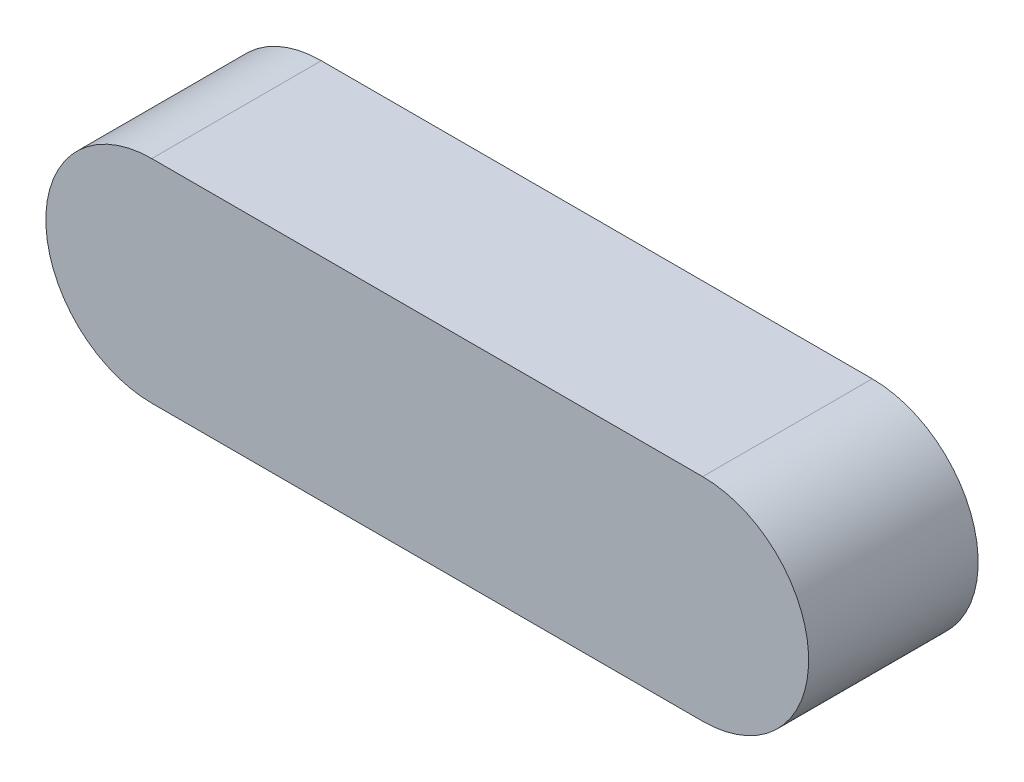
ISO-10303-21;
HEADER;
FILE_DESCRIPTION(('STEP AP214'),'2;1');
FILE_NAME('part.step','',(''),(''),'','','');
FILE_SCHEMA(('AUTOMOTIVE_DESIGN { 1 0 10303 214 1 1 1 1 }'));
ENDSEC;
DATA;
#1=APPLICATION_CONTEXT('core data for automotive mechanical design processes');
#2=APPLICATION_PROTOCOL_DEFINITION('international standard','automotive_design',2000,#1);
#3=PRODUCT_CONTEXT('',#1,'mechanical');
#4=PRODUCT('Part','Part','',(#3));
#5=PRODUCT_RELATED_PRODUCT_CATEGORY('part','',(#4));
#6=PRODUCT_DEFINITION_FORMATION('','',#4);
#7=PRODUCT_DEFINITION_CONTEXT('part definition',#1,'design');
#8=PRODUCT_DEFINITION('design','',#6,#7);
#9=PRODUCT_DEFINITION_SHAPE('','',#8);
#10=(LENGTH_UNIT() NAMED_UNIT(*) SI_UNIT(.MILLI.,.METRE.));
#11=(NAMED_UNIT(*) PLANE_ANGLE_UNIT() SI_UNIT($,.RADIAN.));
#12=(NAMED_UNIT(*) SI_UNIT($,.STERADIAN.) SOLID_ANGLE_UNIT());
#13=UNCERTAINTY_MEASURE_WITH_UNIT(LENGTH_MEASURE(1.E-05),#10,'distance_accuracy_value','');
#14=(GEOMETRIC_REPRESENTATION_CONTEXT(3) GLOBAL_UNCERTAINTY_ASSIGNED_CONTEXT((#13)) GLOBAL_UNIT_ASSIGNED_CONTEXT((#10,
#11,#12)) REPRESENTATION_CONTEXT('',''));
#15=CARTESIAN_POINT('',(0.,0.,0.));
#16=DIRECTION('',(0.,0.,1.));
#17=DIRECTION('',(1.,0.,0.));
#18=AXIS2_PLACEMENT_3D('',#15,#16,#17);
#19=CARTESIAN_POINT('',(-5.41501976284585,0.,8.));
#20=DIRECTION('',(0.,0.,-1.));
#21=DIRECTION('',(-1.,0.,0.));
#22=AXIS2_PLACEMENT_3D('',#19,#20,#21);
#23=CYLINDRICAL_SURFACE('',#22,5.);
#24=CARTESIAN_POINT('',(-5.41501976284585,0.,0.));
#25=DIRECTION('',(0.,0.,1.));
#26=DIRECTION('',(1.,0.,0.));
#27=AXIS2_PLACEMENT_3D('',#24,#25,#26);
#28=CIRCLE('',#27,5.);
#29=CARTESIAN_POINT('',(-5.41501976284585,5.,0.));
#30=VERTEX_POINT('',#29);
#31=CARTESIAN_POINT('',(-5.41501976284585,-5.,0.));
#32=VERTEX_POINT('',#31);
#33=EDGE_CURVE('E107',#30,#32,#28,.T.);
#34=ORIENTED_EDGE('',*,*,#33,.T.);
#35=DIRECTION('',(0.,0.,-1.));
#36=VECTOR('',#35,1.);
#37=CARTESIAN_POINT('',(-5.41501976284585,-5.,8.));
#38=LINE('',#37,#36);
#39=CARTESIAN_POINT('',(-5.41501976284585,-5.,8.));
#40=VERTEX_POINT('',#39);
#41=EDGE_CURVE('E11',#40,#32,#38,.T.);
#42=ORIENTED_EDGE('',*,*,#41,.F.);
#43=CARTESIAN_POINT('',(-5.41501976284585,0.,8.));
#44=DIRECTION('',(0.,0.,1.));
#45=DIRECTION('',(1.,0.,0.));
#46=AXIS2_PLACEMENT_3D('',#43,#44,#45);
#47=CIRCLE('',#46,5.);
#48=CARTESIAN_POINT('',(-5.41501976284585,5.,8.));
#49=VERTEX_POINT('',#48);
#50=EDGE_CURVE('E91',#49,#40,#47,.T.);
#51=ORIENTED_EDGE('',*,*,#50,.F.);
#52=DIRECTION('',(0.,0.,-1.));
#53=VECTOR('',#52,1.);
#54=CARTESIAN_POINT('',(-5.41501976284585,5.,8.));
#55=LINE('',#54,#53);
#56=EDGE_CURVE('E103',#49,#30,#55,.T.);
#57=ORIENTED_EDGE('',*,*,#56,.T.);
#58=EDGE_LOOP('',(#34,#42,#51,#57));
#59=FACE_BOUND('',#58,.T.);
#60=ADVANCED_FACE('F39',(#59),#23,.T.);
#61=CARTESIAN_POINT('',(-5.41501976284585,-5.,8.));
#62=DIRECTION('',(0.,1.,0.));
#63=DIRECTION('',(0.,0.,1.));
#64=AXIS2_PLACEMENT_3D('',#61,#62,#63);
#65=PLANE('',#64);
#66=DIRECTION('',(1.,0.,0.));
#67=VECTOR('',#66,1.);
#68=CARTESIAN_POINT('',(-5.41501976284585,-5.,0.));
#69=LINE('',#68,#67);
#70=CARTESIAN_POINT('',(20.5849802371542,-5.,0.));
#71=VERTEX_POINT('',#70);
#72=EDGE_CURVE('E96',#32,#71,#69,.T.);
#73=ORIENTED_EDGE('',*,*,#72,.T.);
#74=DIRECTION('',(0.,0.,-1.));
#75=VECTOR('',#74,1.);
#76=CARTESIAN_POINT('',(20.5849802371542,-5.,8.));
#77=LINE('',#76,#75);
#78=CARTESIAN_POINT('',(20.5849802371542,-5.,8.));
#79=VERTEX_POINT('',#78);
#80=EDGE_CURVE('E48',#79,#71,#77,.T.);
#81=ORIENTED_EDGE('',*,*,#80,.F.);
#82=DIRECTION('',(1.,0.,0.));
#83=VECTOR('',#82,1.);
#84=CARTESIAN_POINT('',(-5.41501976284585,-5.,8.));
#85=LINE('',#84,#83);
#86=EDGE_CURVE('E86',#40,#79,#85,.T.);
#87=ORIENTED_EDGE('',*,*,#86,.F.);
#88=ORIENTED_EDGE('',*,*,#41,.T.);
#89=EDGE_LOOP('',(#73,#81,#87,#88));
#90=FACE_BOUND('',#89,.T.);
#91=ADVANCED_FACE('F95',(#90),#65,.F.);
#92=CARTESIAN_POINT('',(20.5849802371542,0.,8.));
#93=DIRECTION('',(0.,0.,-1.));
#94=DIRECTION('',(-1.,0.,0.));
#95=AXIS2_PLACEMENT_3D('',#92,#93,#94);
#96=CYLINDRICAL_SURFACE('',#95,5.);
#97=CARTESIAN_POINT('',(20.5849802371542,0.,0.));
#98=DIRECTION('',(0.,0.,1.));
#99=DIRECTION('',(1.,0.,0.));
#100=AXIS2_PLACEMENT_3D('',#97,#98,#99);
#101=CIRCLE('',#100,5.);
#102=CARTESIAN_POINT('',(20.5849802371542,5.,0.));
#103=VERTEX_POINT('',#102);
#104=EDGE_CURVE('E73',#71,#103,#101,.T.);
#105=ORIENTED_EDGE('',*,*,#104,.T.);
#106=DIRECTION('',(0.,0.,-1.));
#107=VECTOR('',#106,1.);
#108=CARTESIAN_POINT('',(20.5849802371542,5.,8.));
#109=LINE('',#108,#107);
#110=CARTESIAN_POINT('',(20.5849802371542,5.,8.));
#111=VERTEX_POINT('',#110);
#112=EDGE_CURVE('E98',#111,#103,#109,.T.);
#113=ORIENTED_EDGE('',*,*,#112,.F.);
#114=CARTESIAN_POINT('',(20.5849802371542,0.,8.));
#115=DIRECTION('',(0.,0.,1.));
#116=DIRECTION('',(1.,0.,0.));
#117=AXIS2_PLACEMENT_3D('',#114,#115,#116);
#118=CIRCLE('',#117,5.);
#119=EDGE_CURVE('E89',#79,#111,#118,.T.);
#120=ORIENTED_EDGE('',*,*,#119,.F.);
#121=ORIENTED_EDGE('',*,*,#80,.T.);
#122=EDGE_LOOP('',(#105,#113,#120,#121));
#123=FACE_BOUND('',#122,.T.);
#124=ADVANCED_FACE('F99',(#123),#96,.T.);
#125=CARTESIAN_POINT('',(-5.41501976284585,5.,8.));
#126=DIRECTION('',(0.,-1.,0.));
#127=DIRECTION('',(0.,0.,-1.));
#128=AXIS2_PLACEMENT_3D('',#125,#126,#127);
#129=PLANE('',#128);
#130=DIRECTION('',(-1.,0.,0.));
#131=VECTOR('',#130,1.);
#132=CARTESIAN_POINT('',(-5.41501976284585,5.,0.));
#133=LINE('',#132,#131);
#134=EDGE_CURVE('E79',#103,#30,#133,.T.);
#135=ORIENTED_EDGE('',*,*,#134,.T.);
#136=ORIENTED_EDGE('',*,*,#56,.F.);
#137=DIRECTION('',(-1.,0.,0.));
#138=VECTOR('',#137,1.);
#139=CARTESIAN_POINT('',(-5.41501976284585,5.,8.));
#140=LINE('',#139,#138);
#141=EDGE_CURVE('E56',#111,#49,#140,.T.);
#142=ORIENTED_EDGE('',*,*,#141,.F.);
#143=ORIENTED_EDGE('',*,*,#112,.T.);
#144=EDGE_LOOP('',(#135,#136,#142,#143));
#145=FACE_BOUND('',#144,.T.);
#146=ADVANCED_FACE('F120',(#145),#129,.F.);
#147=CARTESIAN_POINT('',(-5.41501976284585,0.,8.));
#148=DIRECTION('',(0.,0.,1.));
#149=DIRECTION('',(1.,0.,0.));
#150=AXIS2_PLACEMENT_3D('',#147,#148,#149);
#151=PLANE('',#150);
#152=ORIENTED_EDGE('',*,*,#50,.T.);
#153=ORIENTED_EDGE('',*,*,#86,.T.);
#154=ORIENTED_EDGE('',*,*,#119,.T.);
#155=ORIENTED_EDGE('',*,*,#141,.T.);
#156=EDGE_LOOP('',(#152,#153,#154,#155));
#157=FACE_BOUND('',#156,.T.);
#158=ADVANCED_FACE('F87',(#157),#151,.T.);
#159=CARTESIAN_POINT('',(-5.41501976284585,0.,0.));
#160=DIRECTION('',(0.,0.,1.));
#161=DIRECTION('',(1.,0.,0.));
#162=AXIS2_PLACEMENT_3D('',#159,#160,#161);
#163=PLANE('',#162);
#164=ORIENTED_EDGE('',*,*,#33,.F.);
#165=ORIENTED_EDGE('',*,*,#134,.F.);
#166=ORIENTED_EDGE('',*,*,#104,.F.);
#167=ORIENTED_EDGE('',*,*,#72,.F.);
#168=EDGE_LOOP('',(#164,#165,#166,#167));
#169=FACE_BOUND('',#168,.T.);
#170=ADVANCED_FACE('F123',(#169),#163,.F.);
#171=CLOSED_SHELL('',(#60,#91,#124,#146,#158,#170));
#172=MANIFOLD_SOLID_BREP('B2',#171);
#173=ADVANCED_BREP_SHAPE_REPRESENTATION('',(#18,#172),#14);
#174=SHAPE_DEFINITION_REPRESENTATION(#9,#173);
ENDSEC;
END-ISO-10303-21;
